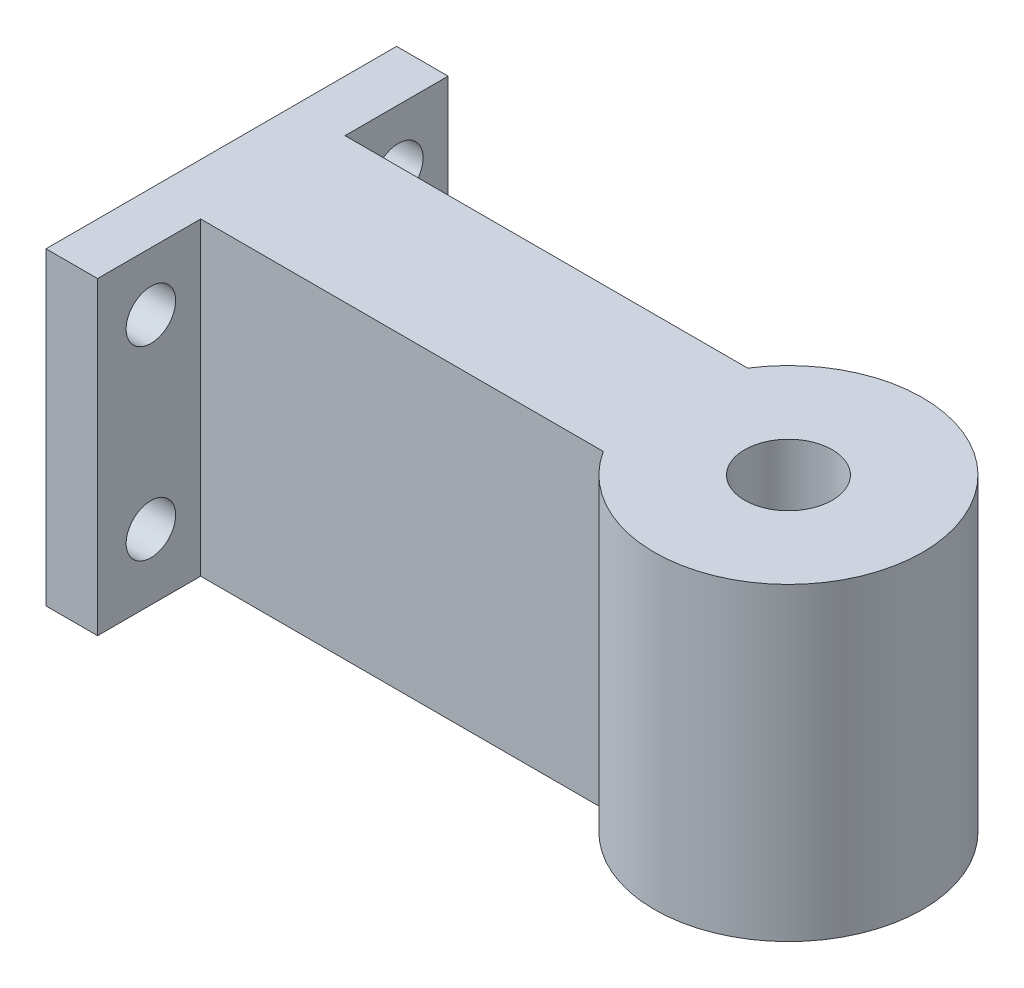
ISO-10303-21;
HEADER;
FILE_DESCRIPTION(('STEP AP214'),'2;1');
FILE_NAME('part.step','',(''),(''),'','','');
FILE_SCHEMA(('AUTOMOTIVE_DESIGN { 1 0 10303 214 1 1 1 1 }'));
ENDSEC;
DATA;
#1=APPLICATION_CONTEXT('core data for automotive mechanical design processes');
#2=APPLICATION_PROTOCOL_DEFINITION('international standard','automotive_design',2000,#1);
#3=PRODUCT_CONTEXT('',#1,'mechanical');
#4=PRODUCT('Part','Part','',(#3));
#5=PRODUCT_RELATED_PRODUCT_CATEGORY('part','',(#4));
#6=PRODUCT_DEFINITION_FORMATION('','',#4);
#7=PRODUCT_DEFINITION_CONTEXT('part definition',#1,'design');
#8=PRODUCT_DEFINITION('design','',#6,#7);
#9=PRODUCT_DEFINITION_SHAPE('','',#8);
#10=(LENGTH_UNIT() NAMED_UNIT(*) SI_UNIT(.MILLI.,.METRE.));
#11=(NAMED_UNIT(*) PLANE_ANGLE_UNIT() SI_UNIT($,.RADIAN.));
#12=(NAMED_UNIT(*) SI_UNIT($,.STERADIAN.) SOLID_ANGLE_UNIT());
#13=UNCERTAINTY_MEASURE_WITH_UNIT(LENGTH_MEASURE(1.E-05),#10,'distance_accuracy_value','');
#14=(GEOMETRIC_REPRESENTATION_CONTEXT(3) GLOBAL_UNCERTAINTY_ASSIGNED_CONTEXT((#13)) GLOBAL_UNIT_ASSIGNED_CONTEXT((#10,
#11,#12)) REPRESENTATION_CONTEXT('',''));
#15=CARTESIAN_POINT('',(0.,0.,0.));
#16=DIRECTION('',(0.,0.,1.));
#17=DIRECTION('',(1.,0.,0.));
#18=AXIS2_PLACEMENT_3D('',#15,#16,#17);
#19=CARTESIAN_POINT('',(55.,30.,0.));
#20=DIRECTION('',(0.,-1.,0.));
#21=DIRECTION('',(0.,0.,-1.));
#22=AXIS2_PLACEMENT_3D('',#19,#20,#21);
#23=CYLINDRICAL_SURFACE('',#22,4.25000000000001);
#24=CARTESIAN_POINT('',(55.,30.,0.));
#25=DIRECTION('',(0.,1.,0.));
#26=DIRECTION('',(0.,0.,1.));
#27=AXIS2_PLACEMENT_3D('',#24,#25,#26);
#28=CIRCLE('',#27,4.25000000000001);
#29=CARTESIAN_POINT('',(55.,30.,4.24999999999999));
#30=VERTEX_POINT('',#29);
#31=EDGE_CURVE('E141',#30,#30,#28,.T.);
#32=ORIENTED_EDGE('',*,*,#31,.T.);
#33=EDGE_LOOP('',(#32));
#34=FACE_BOUND('',#33,.T.);
#35=CARTESIAN_POINT('',(55.,15.6,0.));
#36=DIRECTION('',(0.,-1.,0.));
#37=DIRECTION('',(0.,0.,-1.));
#38=AXIS2_PLACEMENT_3D('',#35,#36,#37);
#39=CIRCLE('',#38,4.25000000000001);
#40=CARTESIAN_POINT('',(55.,15.6,-4.25000000000002));
#41=VERTEX_POINT('',#40);
#42=EDGE_CURVE('E197',#41,#41,#39,.T.);
#43=ORIENTED_EDGE('',*,*,#42,.T.);
#44=EDGE_LOOP('',(#43));
#45=FACE_BOUND('',#44,.T.);
#46=ADVANCED_FACE('F39',(#34,#45),#23,.F.);
#47=CARTESIAN_POINT('',(55.,30.,0.));
#48=DIRECTION('',(0.,-1.,0.));
#49=DIRECTION('',(0.,0.,-1.));
#50=AXIS2_PLACEMENT_3D('',#47,#48,#49);
#51=PLANE('',#50);
#52=DIRECTION('',(-1.,0.,0.));
#53=VECTOR('',#52,1.);
#54=CARTESIAN_POINT('',(4.99999999999999,30.,-17.));
#55=LINE('',#54,#53);
#56=CARTESIAN_POINT('',(4.99999999999999,30.,-17.));
#57=VERTEX_POINT('',#56);
#58=CARTESIAN_POINT('',(0.,30.,-17.));
#59=VERTEX_POINT('',#58);
#60=EDGE_CURVE('E152',#57,#59,#55,.T.);
#61=ORIENTED_EDGE('',*,*,#60,.T.);
#62=DIRECTION('',(0.,0.,1.));
#63=VECTOR('',#62,1.);
#64=CARTESIAN_POINT('',(0.,30.,-17.));
#65=LINE('',#64,#63);
#66=CARTESIAN_POINT('',(0.,30.,17.));
#67=VERTEX_POINT('',#66);
#68=EDGE_CURVE('E99',#59,#67,#65,.T.);
#69=ORIENTED_EDGE('',*,*,#68,.T.);
#70=DIRECTION('',(1.,0.,0.));
#71=VECTOR('',#70,1.);
#72=CARTESIAN_POINT('',(0.,30.,17.));
#73=LINE('',#72,#71);
#74=CARTESIAN_POINT('',(5.,30.,17.));
#75=VERTEX_POINT('',#74);
#76=EDGE_CURVE('E167',#67,#75,#73,.T.);
#77=ORIENTED_EDGE('',*,*,#76,.T.);
#78=DIRECTION('',(0.,0.,-1.));
#79=VECTOR('',#78,1.);
#80=CARTESIAN_POINT('',(5.,30.,17.));
#81=LINE('',#80,#79);
#82=CARTESIAN_POINT('',(5.,30.,7.));
#83=VERTEX_POINT('',#82);
#84=EDGE_CURVE('E179',#75,#83,#81,.T.);
#85=ORIENTED_EDGE('',*,*,#84,.T.);
#86=DIRECTION('',(1.,0.,0.));
#87=VECTOR('',#86,1.);
#88=CARTESIAN_POINT('',(5.,30.,7.));
#89=LINE('',#88,#87);
#90=CARTESIAN_POINT('',(44.0455488498967,30.,7.));
#91=VERTEX_POINT('',#90);
#92=EDGE_CURVE('E119',#83,#91,#89,.T.);
#93=ORIENTED_EDGE('',*,*,#92,.T.);
#94=CARTESIAN_POINT('',(55.,30.,0.));
#95=DIRECTION('',(0.,1.,0.));
#96=DIRECTION('',(0.,0.,-1.));
#97=AXIS2_PLACEMENT_3D('',#94,#95,#96);
#98=CIRCLE('',#97,13.);
#99=CARTESIAN_POINT('',(44.0455488498967,30.,-7.00000000000002));
#100=VERTEX_POINT('',#99);
#101=EDGE_CURVE('E112',#91,#100,#98,.T.);
#102=ORIENTED_EDGE('',*,*,#101,.T.);
#103=DIRECTION('',(-1.,0.,0.));
#104=VECTOR('',#103,1.);
#105=CARTESIAN_POINT('',(44.0455488498967,30.,-7.00000000000002));
#106=LINE('',#105,#104);
#107=CARTESIAN_POINT('',(5.,30.,-7.));
#108=VERTEX_POINT('',#107);
#109=EDGE_CURVE('E117',#100,#108,#106,.T.);
#110=ORIENTED_EDGE('',*,*,#109,.T.);
#111=DIRECTION('',(0.,0.,-1.));
#112=VECTOR('',#111,1.);
#113=CARTESIAN_POINT('',(5.,30.,-7.));
#114=LINE('',#113,#112);
#115=EDGE_CURVE('E56',#108,#57,#114,.T.);
#116=ORIENTED_EDGE('',*,*,#115,.T.);
#117=EDGE_LOOP('',(#61,#69,#77,#85,#93,#102,#110,#116));
#118=FACE_BOUND('',#117,.T.);
#119=ORIENTED_EDGE('',*,*,#31,.F.);
#120=EDGE_LOOP('',(#119));
#121=FACE_BOUND('',#120,.T.);
#122=ADVANCED_FACE('F114',(#118,#121),#51,.F.);
#123=CARTESIAN_POINT('',(55.,0.,0.));
#124=DIRECTION('',(0.,-1.,0.));
#125=DIRECTION('',(0.,0.,-1.));
#126=AXIS2_PLACEMENT_3D('',#123,#124,#125);
#127=PLANE('',#126);
#128=CARTESIAN_POINT('',(55.,0.,0.));
#129=DIRECTION('',(0.,-1.,0.));
#130=DIRECTION('',(0.,0.,-1.));
#131=AXIS2_PLACEMENT_3D('',#128,#129,#130);
#132=CIRCLE('',#131,11.25);
#133=CARTESIAN_POINT('',(55.,0.,-11.25));
#134=VERTEX_POINT('',#133);
#135=EDGE_CURVE('E188',#134,#134,#132,.T.);
#136=ORIENTED_EDGE('',*,*,#135,.F.);
#137=EDGE_LOOP('',(#136));
#138=FACE_BOUND('',#137,.T.);
#139=DIRECTION('',(-1.,0.,0.));
#140=VECTOR('',#139,1.);
#141=CARTESIAN_POINT('',(4.99999999999999,0.,-17.));
#142=LINE('',#141,#140);
#143=CARTESIAN_POINT('',(4.99999999999999,0.,-17.));
#144=VERTEX_POINT('',#143);
#145=CARTESIAN_POINT('',(0.,0.,-17.));
#146=VERTEX_POINT('',#145);
#147=EDGE_CURVE('E137',#144,#146,#142,.T.);
#148=ORIENTED_EDGE('',*,*,#147,.F.);
#149=DIRECTION('',(0.,0.,-1.));
#150=VECTOR('',#149,1.);
#151=CARTESIAN_POINT('',(5.,0.,-7.));
#152=LINE('',#151,#150);
#153=CARTESIAN_POINT('',(5.,0.,-7.));
#154=VERTEX_POINT('',#153);
#155=EDGE_CURVE('E91',#154,#144,#152,.T.);
#156=ORIENTED_EDGE('',*,*,#155,.F.);
#157=DIRECTION('',(-1.,0.,0.));
#158=VECTOR('',#157,1.);
#159=CARTESIAN_POINT('',(44.0455488498967,0.,-7.00000000000002));
#160=LINE('',#159,#158);
#161=CARTESIAN_POINT('',(44.0455488498967,0.,-7.00000000000002));
#162=VERTEX_POINT('',#161);
#163=EDGE_CURVE('E85',#162,#154,#160,.T.);
#164=ORIENTED_EDGE('',*,*,#163,.F.);
#165=CARTESIAN_POINT('',(55.,0.,0.));
#166=DIRECTION('',(0.,1.,0.));
#167=DIRECTION('',(0.,0.,-1.));
#168=AXIS2_PLACEMENT_3D('',#165,#166,#167);
#169=CIRCLE('',#168,13.);
#170=CARTESIAN_POINT('',(44.0455488498967,0.,7.));
#171=VERTEX_POINT('',#170);
#172=EDGE_CURVE('E127',#171,#162,#169,.T.);
#173=ORIENTED_EDGE('',*,*,#172,.F.);
#174=DIRECTION('',(1.,0.,0.));
#175=VECTOR('',#174,1.);
#176=CARTESIAN_POINT('',(5.,0.,7.));
#177=LINE('',#176,#175);
#178=CARTESIAN_POINT('',(5.,0.,7.));
#179=VERTEX_POINT('',#178);
#180=EDGE_CURVE('E147',#179,#171,#177,.T.);
#181=ORIENTED_EDGE('',*,*,#180,.F.);
#182=DIRECTION('',(0.,0.,-1.));
#183=VECTOR('',#182,1.);
#184=CARTESIAN_POINT('',(5.,0.,17.));
#185=LINE('',#184,#183);
#186=CARTESIAN_POINT('',(5.,0.,17.));
#187=VERTEX_POINT('',#186);
#188=EDGE_CURVE('E145',#187,#179,#185,.T.);
#189=ORIENTED_EDGE('',*,*,#188,.F.);
#190=DIRECTION('',(1.,0.,0.));
#191=VECTOR('',#190,1.);
#192=CARTESIAN_POINT('',(0.,0.,17.));
#193=LINE('',#192,#191);
#194=CARTESIAN_POINT('',(0.,0.,17.));
#195=VERTEX_POINT('',#194);
#196=EDGE_CURVE('E143',#195,#187,#193,.T.);
#197=ORIENTED_EDGE('',*,*,#196,.F.);
#198=DIRECTION('',(0.,0.,1.));
#199=VECTOR('',#198,1.);
#200=CARTESIAN_POINT('',(0.,0.,-17.));
#201=LINE('',#200,#199);
#202=EDGE_CURVE('E140',#146,#195,#201,.T.);
#203=ORIENTED_EDGE('',*,*,#202,.F.);
#204=EDGE_LOOP('',(#148,#156,#164,#173,#181,#189,#197,#203));
#205=FACE_BOUND('',#204,.T.);
#206=ADVANCED_FACE('F171',(#138,#205),#127,.T.);
#207=CARTESIAN_POINT('',(4.99999999999999,30.,-17.));
#208=DIRECTION('',(0.,0.,1.));
#209=DIRECTION('',(1.,0.,0.));
#210=AXIS2_PLACEMENT_3D('',#207,#208,#209);
#211=PLANE('',#210);
#212=ORIENTED_EDGE('',*,*,#147,.T.);
#213=DIRECTION('',(0.,-1.,0.));
#214=VECTOR('',#213,1.);
#215=CARTESIAN_POINT('',(0.,30.,-17.));
#216=LINE('',#215,#214);
#217=EDGE_CURVE('E12',#59,#146,#216,.T.);
#218=ORIENTED_EDGE('',*,*,#217,.F.);
#219=ORIENTED_EDGE('',*,*,#60,.F.);
#220=DIRECTION('',(0.,-1.,0.));
#221=VECTOR('',#220,1.);
#222=CARTESIAN_POINT('',(4.99999999999999,30.,-17.));
#223=LINE('',#222,#221);
#224=EDGE_CURVE('E133',#57,#144,#223,.T.);
#225=ORIENTED_EDGE('',*,*,#224,.T.);
#226=EDGE_LOOP('',(#212,#218,#219,#225));
#227=FACE_BOUND('',#226,.T.);
#228=ADVANCED_FACE('F41',(#227),#211,.F.);
#229=CARTESIAN_POINT('',(0.,30.,-17.));
#230=DIRECTION('',(1.,0.,0.));
#231=DIRECTION('',(0.,0.,-1.));
#232=AXIS2_PLACEMENT_3D('',#229,#230,#231);
#233=PLANE('',#232);
#234=CARTESIAN_POINT('',(0.,24.3634390627818,11.8281321203426));
#235=DIRECTION('',(1.,0.,0.));
#236=DIRECTION('',(0.,0.,-1.));
#237=AXIS2_PLACEMENT_3D('',#234,#235,#236);
#238=CIRCLE('',#237,2.4);
#239=CARTESIAN_POINT('',(0.,24.3634390627818,9.42813212034262));
#240=VERTEX_POINT('',#239);
#241=EDGE_CURVE('E212',#240,#240,#238,.T.);
#242=ORIENTED_EDGE('',*,*,#241,.T.);
#243=EDGE_LOOP('',(#242));
#244=FACE_BOUND('',#243,.T.);
#245=CARTESIAN_POINT('',(0.,6.36343906278182,11.8281321203426));
#246=DIRECTION('',(1.,0.,0.));
#247=DIRECTION('',(0.,0.,-1.));
#248=AXIS2_PLACEMENT_3D('',#245,#246,#247);
#249=CIRCLE('',#248,2.4);
#250=CARTESIAN_POINT('',(0.,6.36343906278182,9.42813212034262));
#251=VERTEX_POINT('',#250);
#252=EDGE_CURVE('E218',#251,#251,#249,.T.);
#253=ORIENTED_EDGE('',*,*,#252,.T.);
#254=EDGE_LOOP('',(#253));
#255=FACE_BOUND('',#254,.T.);
#256=CARTESIAN_POINT('',(0.,6.36343906278182,-12.1718678796574));
#257=DIRECTION('',(1.,0.,0.));
#258=DIRECTION('',(0.,0.,-1.));
#259=AXIS2_PLACEMENT_3D('',#256,#257,#258);
#260=CIRCLE('',#259,2.4);
#261=CARTESIAN_POINT('',(0.,6.36343906278182,-14.5718678796574));
#262=VERTEX_POINT('',#261);
#263=EDGE_CURVE('E206',#262,#262,#260,.T.);
#264=ORIENTED_EDGE('',*,*,#263,.T.);
#265=EDGE_LOOP('',(#264));
#266=FACE_BOUND('',#265,.T.);
#267=CARTESIAN_POINT('',(0.,24.3634390627818,-12.1718678796574));
#268=DIRECTION('',(1.,0.,0.));
#269=DIRECTION('',(0.,0.,-1.));
#270=AXIS2_PLACEMENT_3D('',#267,#268,#269);
#271=CIRCLE('',#270,2.4);
#272=CARTESIAN_POINT('',(0.,24.3634390627818,-14.5718678796574));
#273=VERTEX_POINT('',#272);
#274=EDGE_CURVE('E202',#273,#273,#271,.T.);
#275=ORIENTED_EDGE('',*,*,#274,.T.);
#276=EDGE_LOOP('',(#275));
#277=FACE_BOUND('',#276,.T.);
#278=ORIENTED_EDGE('',*,*,#202,.T.);
#279=DIRECTION('',(0.,-1.,0.));
#280=VECTOR('',#279,1.);
#281=CARTESIAN_POINT('',(0.,30.,17.));
#282=LINE('',#281,#280);
#283=EDGE_CURVE('E48',#67,#195,#282,.T.);
#284=ORIENTED_EDGE('',*,*,#283,.F.);
#285=ORIENTED_EDGE('',*,*,#68,.F.);
#286=ORIENTED_EDGE('',*,*,#217,.T.);
#287=EDGE_LOOP('',(#278,#284,#285,#286));
#288=FACE_BOUND('',#287,.T.);
#289=ADVANCED_FACE('F227',(#244,#255,#266,#277,#288),#233,.F.);
#290=CARTESIAN_POINT('',(0.,30.,17.));
#291=DIRECTION('',(0.,0.,-1.));
#292=DIRECTION('',(-1.,0.,0.));
#293=AXIS2_PLACEMENT_3D('',#290,#291,#292);
#294=PLANE('',#293);
#295=ORIENTED_EDGE('',*,*,#196,.T.);
#296=DIRECTION('',(0.,-1.,0.));
#297=VECTOR('',#296,1.);
#298=CARTESIAN_POINT('',(5.,30.,17.));
#299=LINE('',#298,#297);
#300=EDGE_CURVE('E159',#75,#187,#299,.T.);
#301=ORIENTED_EDGE('',*,*,#300,.F.);
#302=ORIENTED_EDGE('',*,*,#76,.F.);
#303=ORIENTED_EDGE('',*,*,#283,.T.);
#304=EDGE_LOOP('',(#295,#301,#302,#303));
#305=FACE_BOUND('',#304,.T.);
#306=ADVANCED_FACE('F165',(#305),#294,.F.);
#307=CARTESIAN_POINT('',(5.,30.,17.));
#308=DIRECTION('',(-1.,0.,0.));
#309=DIRECTION('',(0.,0.,1.));
#310=AXIS2_PLACEMENT_3D('',#307,#308,#309);
#311=PLANE('',#310);
#312=CARTESIAN_POINT('',(5.00000000000001,24.3634390627818,11.8281321203426));
#313=DIRECTION('',(1.,0.,0.));
#314=DIRECTION('',(0.,0.,-1.));
#315=AXIS2_PLACEMENT_3D('',#312,#313,#314);
#316=CIRCLE('',#315,2.4);
#317=CARTESIAN_POINT('',(5.00000000000001,24.3634390627818,9.42813212034261));
#318=VERTEX_POINT('',#317);
#319=EDGE_CURVE('E209',#318,#318,#316,.T.);
#320=ORIENTED_EDGE('',*,*,#319,.F.);
#321=EDGE_LOOP('',(#320));
#322=FACE_BOUND('',#321,.T.);
#323=CARTESIAN_POINT('',(5.00000000000001,6.36343906278182,11.8281321203426));
#324=DIRECTION('',(1.,0.,0.));
#325=DIRECTION('',(0.,0.,-1.));
#326=AXIS2_PLACEMENT_3D('',#323,#324,#325);
#327=CIRCLE('',#326,2.4);
#328=CARTESIAN_POINT('',(5.00000000000001,6.36343906278182,9.42813212034261));
#329=VERTEX_POINT('',#328);
#330=EDGE_CURVE('E215',#329,#329,#327,.T.);
#331=ORIENTED_EDGE('',*,*,#330,.F.);
#332=EDGE_LOOP('',(#331));
#333=FACE_BOUND('',#332,.T.);
#334=ORIENTED_EDGE('',*,*,#188,.T.);
#335=DIRECTION('',(0.,-1.,0.));
#336=VECTOR('',#335,1.);
#337=CARTESIAN_POINT('',(5.,30.,7.));
#338=LINE('',#337,#336);
#339=EDGE_CURVE('E156',#83,#179,#338,.T.);
#340=ORIENTED_EDGE('',*,*,#339,.F.);
#341=ORIENTED_EDGE('',*,*,#84,.F.);
#342=ORIENTED_EDGE('',*,*,#300,.T.);
#343=EDGE_LOOP('',(#334,#340,#341,#342));
#344=FACE_BOUND('',#343,.T.);
#345=ADVANCED_FACE('F175',(#322,#333,#344),#311,.F.);
#346=CARTESIAN_POINT('',(5.,30.,7.));
#347=DIRECTION('',(0.,0.,-1.));
#348=DIRECTION('',(-1.,0.,0.));
#349=AXIS2_PLACEMENT_3D('',#346,#347,#348);
#350=PLANE('',#349);
#351=ORIENTED_EDGE('',*,*,#180,.T.);
#352=DIRECTION('',(0.,-1.,0.));
#353=VECTOR('',#352,1.);
#354=CARTESIAN_POINT('',(44.0455488498967,30.,7.));
#355=LINE('',#354,#353);
#356=EDGE_CURVE('E128',#91,#171,#355,.T.);
#357=ORIENTED_EDGE('',*,*,#356,.F.);
#358=ORIENTED_EDGE('',*,*,#92,.F.);
#359=ORIENTED_EDGE('',*,*,#339,.T.);
#360=EDGE_LOOP('',(#351,#357,#358,#359));
#361=FACE_BOUND('',#360,.T.);
#362=ADVANCED_FACE('F178',(#361),#350,.F.);
#363=CARTESIAN_POINT('',(55.,30.,0.));
#364=DIRECTION('',(0.,-1.,0.));
#365=DIRECTION('',(0.,0.,-1.));
#366=AXIS2_PLACEMENT_3D('',#363,#364,#365);
#367=CYLINDRICAL_SURFACE('',#366,13.);
#368=ORIENTED_EDGE('',*,*,#172,.T.);
#369=DIRECTION('',(0.,-1.,0.));
#370=VECTOR('',#369,1.);
#371=CARTESIAN_POINT('',(44.0455488498967,30.,-7.00000000000002));
#372=LINE('',#371,#370);
#373=EDGE_CURVE('E124',#100,#162,#372,.T.);
#374=ORIENTED_EDGE('',*,*,#373,.F.);
#375=ORIENTED_EDGE('',*,*,#101,.F.);
#376=ORIENTED_EDGE('',*,*,#356,.T.);
#377=EDGE_LOOP('',(#368,#374,#375,#376));
#378=FACE_BOUND('',#377,.T.);
#379=ADVANCED_FACE('F125',(#378),#367,.T.);
#380=CARTESIAN_POINT('',(44.0455488498967,30.,-7.00000000000002));
#381=DIRECTION('',(0.,0.,1.));
#382=DIRECTION('',(1.,0.,0.));
#383=AXIS2_PLACEMENT_3D('',#380,#381,#382);
#384=PLANE('',#383);
#385=ORIENTED_EDGE('',*,*,#163,.T.);
#386=DIRECTION('',(0.,-1.,0.));
#387=VECTOR('',#386,1.);
#388=CARTESIAN_POINT('',(5.,30.,-7.));
#389=LINE('',#388,#387);
#390=EDGE_CURVE('E129',#108,#154,#389,.T.);
#391=ORIENTED_EDGE('',*,*,#390,.F.);
#392=ORIENTED_EDGE('',*,*,#109,.F.);
#393=ORIENTED_EDGE('',*,*,#373,.T.);
#394=EDGE_LOOP('',(#385,#391,#392,#393));
#395=FACE_BOUND('',#394,.T.);
#396=ADVANCED_FACE('F131',(#395),#384,.F.);
#397=CARTESIAN_POINT('',(5.,30.,-7.));
#398=DIRECTION('',(-1.,0.,0.));
#399=DIRECTION('',(0.,0.,1.));
#400=AXIS2_PLACEMENT_3D('',#397,#398,#399);
#401=PLANE('',#400);
#402=CARTESIAN_POINT('',(5.,6.36343906278182,-12.1718678796574));
#403=DIRECTION('',(1.,0.,0.));
#404=DIRECTION('',(0.,0.,-1.));
#405=AXIS2_PLACEMENT_3D('',#402,#403,#404);
#406=CIRCLE('',#405,2.4);
#407=CARTESIAN_POINT('',(4.99999999999999,6.36343906278182,-14.5718678796574));
#408=VERTEX_POINT('',#407);
#409=EDGE_CURVE('E221',#408,#408,#406,.T.);
#410=ORIENTED_EDGE('',*,*,#409,.F.);
#411=EDGE_LOOP('',(#410));
#412=FACE_BOUND('',#411,.T.);
#413=CARTESIAN_POINT('',(5.,24.3634390627818,-12.1718678796574));
#414=DIRECTION('',(1.,0.,0.));
#415=DIRECTION('',(0.,0.,-1.));
#416=AXIS2_PLACEMENT_3D('',#413,#414,#415);
#417=CIRCLE('',#416,2.4);
#418=CARTESIAN_POINT('',(4.99999999999999,24.3634390627818,-14.5718678796574));
#419=VERTEX_POINT('',#418);
#420=EDGE_CURVE('E203',#419,#419,#417,.T.);
#421=ORIENTED_EDGE('',*,*,#420,.F.);
#422=EDGE_LOOP('',(#421));
#423=FACE_BOUND('',#422,.T.);
#424=ORIENTED_EDGE('',*,*,#155,.T.);
#425=ORIENTED_EDGE('',*,*,#224,.F.);
#426=ORIENTED_EDGE('',*,*,#115,.F.);
#427=ORIENTED_EDGE('',*,*,#390,.T.);
#428=EDGE_LOOP('',(#424,#425,#426,#427));
#429=FACE_BOUND('',#428,.T.);
#430=ADVANCED_FACE('F238',(#412,#423,#429),#401,.F.);
#431=CARTESIAN_POINT('',(55.,5.,0.));
#432=DIRECTION('',(0.,-1.,0.));
#433=DIRECTION('',(0.,0.,-1.));
#434=AXIS2_PLACEMENT_3D('',#431,#432,#433);
#435=CYLINDRICAL_SURFACE('',#434,11.25);
#436=CARTESIAN_POINT('',(55.,5.,0.));
#437=DIRECTION('',(0.,-1.,0.));
#438=DIRECTION('',(0.,0.,-1.));
#439=AXIS2_PLACEMENT_3D('',#436,#437,#438);
#440=CIRCLE('',#439,11.25);
#441=CARTESIAN_POINT('',(55.,5.,-11.25));
#442=VERTEX_POINT('',#441);
#443=EDGE_CURVE('E187',#442,#442,#440,.T.);
#444=ORIENTED_EDGE('',*,*,#443,.F.);
#445=EDGE_LOOP('',(#444));
#446=FACE_BOUND('',#445,.T.);
#447=ORIENTED_EDGE('',*,*,#135,.T.);
#448=EDGE_LOOP('',(#447));
#449=FACE_BOUND('',#448,.T.);
#450=ADVANCED_FACE('F241',(#446,#449),#435,.F.);
#451=CARTESIAN_POINT('',(0.,5.,0.));
#452=DIRECTION('',(0.,-1.,0.));
#453=DIRECTION('',(0.,0.,-1.));
#454=AXIS2_PLACEMENT_3D('',#451,#452,#453);
#455=PLANE('',#454);
#456=CARTESIAN_POINT('',(55.,5.,0.));
#457=DIRECTION('',(0.,-1.,0.));
#458=DIRECTION('',(0.,0.,-1.));
#459=AXIS2_PLACEMENT_3D('',#456,#457,#458);
#460=CIRCLE('',#459,5.25);
#461=CARTESIAN_POINT('',(55.,5.,-5.25000000000001));
#462=VERTEX_POINT('',#461);
#463=EDGE_CURVE('E194',#462,#462,#460,.T.);
#464=ORIENTED_EDGE('',*,*,#463,.F.);
#465=EDGE_LOOP('',(#464));
#466=FACE_BOUND('',#465,.T.);
#467=ORIENTED_EDGE('',*,*,#443,.T.);
#468=EDGE_LOOP('',(#467));
#469=FACE_BOUND('',#468,.T.);
#470=ADVANCED_FACE('F356',(#466,#469),#455,.T.);
#471=CARTESIAN_POINT('',(55.,15.6,0.));
#472=DIRECTION('',(0.,-1.,0.));
#473=DIRECTION('',(0.,0.,-1.));
#474=AXIS2_PLACEMENT_3D('',#471,#472,#473);
#475=CYLINDRICAL_SURFACE('',#474,5.25);
#476=CARTESIAN_POINT('',(55.,15.6,0.));
#477=DIRECTION('',(0.,-1.,0.));
#478=DIRECTION('',(0.,0.,-1.));
#479=AXIS2_PLACEMENT_3D('',#476,#477,#478);
#480=CIRCLE('',#479,5.25);
#481=CARTESIAN_POINT('',(55.,15.6,-5.25000000000001));
#482=VERTEX_POINT('',#481);
#483=EDGE_CURVE('E191',#482,#482,#480,.T.);
#484=ORIENTED_EDGE('',*,*,#483,.F.);
#485=EDGE_LOOP('',(#484));
#486=FACE_BOUND('',#485,.T.);
#487=ORIENTED_EDGE('',*,*,#463,.T.);
#488=EDGE_LOOP('',(#487));
#489=FACE_BOUND('',#488,.T.);
#490=ADVANCED_FACE('F252',(#486,#489),#475,.F.);
#491=CARTESIAN_POINT('',(55.,15.6,0.));
#492=DIRECTION('',(0.,-1.,0.));
#493=DIRECTION('',(0.,0.,-1.));
#494=AXIS2_PLACEMENT_3D('',#491,#492,#493);
#495=PLANE('',#494);
#496=ORIENTED_EDGE('',*,*,#42,.F.);
#497=EDGE_LOOP('',(#496));
#498=FACE_BOUND('',#497,.T.);
#499=ORIENTED_EDGE('',*,*,#483,.T.);
#500=EDGE_LOOP('',(#499));
#501=FACE_BOUND('',#500,.T.);
#502=ADVANCED_FACE('F246',(#498,#501),#495,.T.);
#503=CARTESIAN_POINT('',(0.,24.3634390627818,-12.1718678796574));
#504=DIRECTION('',(1.,0.,0.));
#505=DIRECTION('',(0.,0.,-1.));
#506=AXIS2_PLACEMENT_3D('',#503,#504,#505);
#507=CYLINDRICAL_SURFACE('',#506,2.4);
#508=ORIENTED_EDGE('',*,*,#274,.F.);
#509=EDGE_LOOP('',(#508));
#510=FACE_BOUND('',#509,.T.);
#511=ORIENTED_EDGE('',*,*,#420,.T.);
#512=EDGE_LOOP('',(#511));
#513=FACE_BOUND('',#512,.T.);
#514=ADVANCED_FACE('F234',(#510,#513),#507,.F.);
#515=CARTESIAN_POINT('',(0.,6.36343906278182,-12.1718678796574));
#516=DIRECTION('',(1.,0.,0.));
#517=DIRECTION('',(0.,0.,-1.));
#518=AXIS2_PLACEMENT_3D('',#515,#516,#517);
#519=CYLINDRICAL_SURFACE('',#518,2.4);
#520=ORIENTED_EDGE('',*,*,#263,.F.);
#521=EDGE_LOOP('',(#520));
#522=FACE_BOUND('',#521,.T.);
#523=ORIENTED_EDGE('',*,*,#409,.T.);
#524=EDGE_LOOP('',(#523));
#525=FACE_BOUND('',#524,.T.);
#526=ADVANCED_FACE('F230',(#522,#525),#519,.F.);
#527=CARTESIAN_POINT('',(0.,6.36343906278182,11.8281321203426));
#528=DIRECTION('',(1.,0.,0.));
#529=DIRECTION('',(0.,0.,-1.));
#530=AXIS2_PLACEMENT_3D('',#527,#528,#529);
#531=CYLINDRICAL_SURFACE('',#530,2.4);
#532=ORIENTED_EDGE('',*,*,#252,.F.);
#533=EDGE_LOOP('',(#532));
#534=FACE_BOUND('',#533,.T.);
#535=ORIENTED_EDGE('',*,*,#330,.T.);
#536=EDGE_LOOP('',(#535));
#537=FACE_BOUND('',#536,.T.);
#538=ADVANCED_FACE('F233',(#534,#537),#531,.F.);
#539=CARTESIAN_POINT('',(0.,24.3634390627818,11.8281321203426));
#540=DIRECTION('',(1.,0.,0.));
#541=DIRECTION('',(0.,0.,-1.));
#542=AXIS2_PLACEMENT_3D('',#539,#540,#541);
#543=CYLINDRICAL_SURFACE('',#542,2.4);
#544=ORIENTED_EDGE('',*,*,#241,.F.);
#545=EDGE_LOOP('',(#544));
#546=FACE_BOUND('',#545,.T.);
#547=ORIENTED_EDGE('',*,*,#319,.T.);
#548=EDGE_LOOP('',(#547));
#549=FACE_BOUND('',#548,.T.);
#550=ADVANCED_FACE('F293',(#546,#549),#543,.F.);
#551=CLOSED_SHELL('',(#46,#122,#206,#228,#289,#306,#345,#362,#379,#396,#430,#450,#470,#490,#502,
#514,#526,#538,#550));
#552=MANIFOLD_SOLID_BREP('B2',#551);
#553=ADVANCED_BREP_SHAPE_REPRESENTATION('',(#18,#552),#14);
#554=SHAPE_DEFINITION_REPRESENTATION(#9,#553);
ENDSEC;
END-ISO-10303-21;
